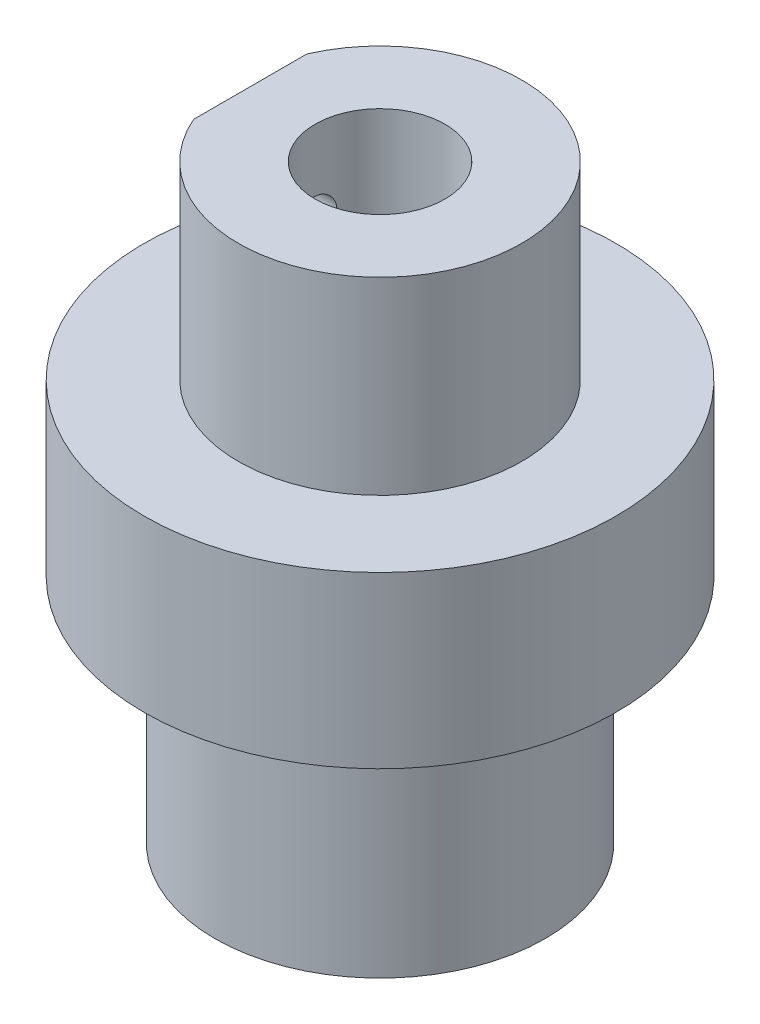
ISO-10303-21;
HEADER;
FILE_DESCRIPTION(('STEP AP214'),'2;1');
FILE_NAME('part.step','',(''),(''),'','','');
FILE_SCHEMA(('AUTOMOTIVE_DESIGN { 1 0 10303 214 1 1 1 1 }'));
ENDSEC;
DATA;
#1=APPLICATION_CONTEXT('core data for automotive mechanical design processes');
#2=APPLICATION_PROTOCOL_DEFINITION('international standard','automotive_design',2000,#1);
#3=PRODUCT_CONTEXT('',#1,'mechanical');
#4=PRODUCT('Part','Part','',(#3));
#5=PRODUCT_RELATED_PRODUCT_CATEGORY('part','',(#4));
#6=PRODUCT_DEFINITION_FORMATION('','',#4);
#7=PRODUCT_DEFINITION_CONTEXT('part definition',#1,'design');
#8=PRODUCT_DEFINITION('design','',#6,#7);
#9=PRODUCT_DEFINITION_SHAPE('','',#8);
#10=(LENGTH_UNIT() NAMED_UNIT(*) SI_UNIT(.MILLI.,.METRE.));
#11=(NAMED_UNIT(*) PLANE_ANGLE_UNIT() SI_UNIT($,.RADIAN.));
#12=(NAMED_UNIT(*) SI_UNIT($,.STERADIAN.) SOLID_ANGLE_UNIT());
#13=UNCERTAINTY_MEASURE_WITH_UNIT(LENGTH_MEASURE(1.E-05),#10,'distance_accuracy_value','');
#14=(GEOMETRIC_REPRESENTATION_CONTEXT(3) GLOBAL_UNCERTAINTY_ASSIGNED_CONTEXT((#13)) GLOBAL_UNIT_ASSIGNED_CONTEXT((#10,
#11,#12)) REPRESENTATION_CONTEXT('',''));
#15=CARTESIAN_POINT('',(0.,0.,0.));
#16=DIRECTION('',(0.,0.,1.));
#17=DIRECTION('',(1.,0.,0.));
#18=AXIS2_PLACEMENT_3D('',#15,#16,#17);
#19=CARTESIAN_POINT('',(0.,17.,0.));
#20=DIRECTION('',(0.,1.,0.));
#21=DIRECTION('',(0.,0.,1.));
#22=AXIS2_PLACEMENT_3D('',#19,#20,#21);
#23=PLANE('',#22);
#24=CARTESIAN_POINT('',(0.,17.,0.));
#25=DIRECTION('',(0.,1.,0.));
#26=DIRECTION('',(0.,0.,1.));
#27=AXIS2_PLACEMENT_3D('',#24,#25,#26);
#28=CIRCLE('',#27,10.);
#29=CARTESIAN_POINT('',(0.,17.,10.));
#30=VERTEX_POINT('',#29);
#31=EDGE_CURVE('E116',#30,#30,#28,.T.);
#32=ORIENTED_EDGE('',*,*,#31,.T.);
#33=EDGE_LOOP('',(#32));
#34=FACE_BOUND('',#33,.T.);
#35=DIRECTION('',(0.,0.,1.));
#36=VECTOR('',#35,1.);
#37=CARTESIAN_POINT('',(-5.5,17.,-2.39791576165636));
#38=LINE('',#37,#36);
#39=CARTESIAN_POINT('',(-5.5,17.,-2.39791576165636));
#40=VERTEX_POINT('',#39);
#41=CARTESIAN_POINT('',(-5.5,17.,2.39791576165636));
#42=VERTEX_POINT('',#41);
#43=EDGE_CURVE('E83',#40,#42,#38,.T.);
#44=ORIENTED_EDGE('',*,*,#43,.F.);
#45=CARTESIAN_POINT('',(0.,17.,0.));
#46=DIRECTION('',(0.,1.,0.));
#47=DIRECTION('',(0.,0.,1.));
#48=AXIS2_PLACEMENT_3D('',#45,#46,#47);
#49=CIRCLE('',#48,6.);
#50=EDGE_CURVE('E68',#42,#40,#49,.T.);
#51=ORIENTED_EDGE('',*,*,#50,.F.);
#52=EDGE_LOOP('',(#44,#51));
#53=FACE_BOUND('',#52,.T.);
#54=ADVANCED_FACE('F45',(#34,#53),#23,.T.);
#55=CARTESIAN_POINT('',(0.,9.8,0.));
#56=DIRECTION('',(0.,-1.,0.));
#57=DIRECTION('',(0.,0.,-1.));
#58=AXIS2_PLACEMENT_3D('',#55,#56,#57);
#59=CYLINDRICAL_SURFACE('',#58,7.);
#60=CARTESIAN_POINT('',(0.,9.8,0.));
#61=DIRECTION('',(0.,1.,0.));
#62=DIRECTION('',(0.,0.,1.));
#63=AXIS2_PLACEMENT_3D('',#60,#61,#62);
#64=CIRCLE('',#63,7.);
#65=CARTESIAN_POINT('',(0.,9.8,7.));
#66=VERTEX_POINT('',#65);
#67=EDGE_CURVE('E11',#66,#66,#64,.T.);
#68=ORIENTED_EDGE('',*,*,#67,.F.);
#69=EDGE_LOOP('',(#68));
#70=FACE_BOUND('',#69,.T.);
#71=CARTESIAN_POINT('',(0.,0.,0.));
#72=DIRECTION('',(0.,1.,0.));
#73=DIRECTION('',(0.,0.,1.));
#74=AXIS2_PLACEMENT_3D('',#71,#72,#73);
#75=CIRCLE('',#74,7.);
#76=CARTESIAN_POINT('',(0.,0.,7.));
#77=VERTEX_POINT('',#76);
#78=EDGE_CURVE('E60',#77,#77,#75,.T.);
#79=ORIENTED_EDGE('',*,*,#78,.T.);
#80=EDGE_LOOP('',(#79));
#81=FACE_BOUND('',#80,.T.);
#82=ADVANCED_FACE('F47',(#70,#81),#59,.T.);
#83=CARTESIAN_POINT('',(0.,0.,0.));
#84=DIRECTION('',(0.,1.,0.));
#85=DIRECTION('',(0.,0.,1.));
#86=AXIS2_PLACEMENT_3D('',#83,#84,#85);
#87=PLANE('',#86);
#88=CARTESIAN_POINT('',(0.,0.,0.));
#89=DIRECTION('',(0.,-1.,0.));
#90=DIRECTION('',(0.,0.,-1.));
#91=AXIS2_PLACEMENT_3D('',#88,#89,#90);
#92=CIRCLE('',#91,3.39999999999999);
#93=CARTESIAN_POINT('',(0.,0.,-3.39999999999999));
#94=VERTEX_POINT('',#93);
#95=EDGE_CURVE('E107',#94,#94,#92,.T.);
#96=ORIENTED_EDGE('',*,*,#95,.F.);
#97=EDGE_LOOP('',(#96));
#98=FACE_BOUND('',#97,.T.);
#99=ORIENTED_EDGE('',*,*,#78,.F.);
#100=EDGE_LOOP('',(#99));
#101=FACE_BOUND('',#100,.T.);
#102=ADVANCED_FACE('F127',(#98,#101),#87,.F.);
#103=CARTESIAN_POINT('',(0.,17.,0.));
#104=DIRECTION('',(0.,-1.,0.));
#105=DIRECTION('',(0.,0.,-1.));
#106=AXIS2_PLACEMENT_3D('',#103,#104,#105);
#107=CYLINDRICAL_SURFACE('',#106,10.);
#108=ORIENTED_EDGE('',*,*,#31,.F.);
#109=EDGE_LOOP('',(#108));
#110=FACE_BOUND('',#109,.T.);
#111=CARTESIAN_POINT('',(0.,9.8,0.));
#112=DIRECTION('',(0.,1.,0.));
#113=DIRECTION('',(0.,0.,1.));
#114=AXIS2_PLACEMENT_3D('',#111,#112,#113);
#115=CIRCLE('',#114,10.);
#116=CARTESIAN_POINT('',(0.,9.8,10.));
#117=VERTEX_POINT('',#116);
#118=EDGE_CURVE('E115',#117,#117,#115,.T.);
#119=ORIENTED_EDGE('',*,*,#118,.T.);
#120=EDGE_LOOP('',(#119));
#121=FACE_BOUND('',#120,.T.);
#122=ADVANCED_FACE('F129',(#110,#121),#107,.T.);
#123=CARTESIAN_POINT('',(0.,9.8,0.));
#124=DIRECTION('',(0.,1.,0.));
#125=DIRECTION('',(0.,0.,1.));
#126=AXIS2_PLACEMENT_3D('',#123,#124,#125);
#127=PLANE('',#126);
#128=ORIENTED_EDGE('',*,*,#67,.T.);
#129=EDGE_LOOP('',(#128));
#130=FACE_BOUND('',#129,.T.);
#131=ORIENTED_EDGE('',*,*,#118,.F.);
#132=EDGE_LOOP('',(#131));
#133=FACE_BOUND('',#132,.T.);
#134=ADVANCED_FACE('F135',(#130,#133),#127,.F.);
#135=CARTESIAN_POINT('',(0.,0.,0.));
#136=DIRECTION('',(0.,-1.,0.));
#137=DIRECTION('',(0.,0.,-1.));
#138=AXIS2_PLACEMENT_3D('',#135,#136,#137);
#139=CYLINDRICAL_SURFACE('',#138,3.39999999999999);
#140=CARTESIAN_POINT('',(0.,17.,0.));
#141=DIRECTION('',(0.,-1.,0.));
#142=DIRECTION('',(0.,0.,-1.));
#143=AXIS2_PLACEMENT_3D('',#140,#141,#142);
#144=CIRCLE('',#143,3.39999999999999);
#145=CARTESIAN_POINT('',(0.,17.,-3.39999999999999));
#146=VERTEX_POINT('',#145);
#147=EDGE_CURVE('E111',#146,#146,#144,.T.);
#148=ORIENTED_EDGE('',*,*,#147,.F.);
#149=EDGE_LOOP('',(#148));
#150=FACE_BOUND('',#149,.T.);
#151=ORIENTED_EDGE('',*,*,#95,.T.);
#152=EDGE_LOOP('',(#151));
#153=FACE_BOUND('',#152,.T.);
#154=ADVANCED_FACE('F147',(#150,#153),#139,.F.);
#155=CARTESIAN_POINT('',(0.,17.,0.));
#156=DIRECTION('',(0.,1.,0.));
#157=DIRECTION('',(0.,0.,1.));
#158=AXIS2_PLACEMENT_3D('',#155,#156,#157);
#159=PLANE('',#158);
#160=CARTESIAN_POINT('',(0.,17.,0.));
#161=DIRECTION('',(0.,1.,0.));
#162=DIRECTION('',(0.,0.,1.));
#163=AXIS2_PLACEMENT_3D('',#160,#161,#162);
#164=CIRCLE('',#163,2.75);
#165=CARTESIAN_POINT('',(0.,17.,2.75));
#166=VERTEX_POINT('',#165);
#167=EDGE_CURVE('E96',#166,#166,#164,.T.);
#168=ORIENTED_EDGE('',*,*,#167,.T.);
#169=EDGE_LOOP('',(#168));
#170=FACE_BOUND('',#169,.T.);
#171=ORIENTED_EDGE('',*,*,#147,.T.);
#172=EDGE_LOOP('',(#171));
#173=FACE_BOUND('',#172,.T.);
#174=ADVANCED_FACE('F154',(#170,#173),#159,.F.);
#175=CARTESIAN_POINT('',(0.,25.,0.));
#176=DIRECTION('',(0.,-1.,0.));
#177=DIRECTION('',(0.,0.,-1.));
#178=AXIS2_PLACEMENT_3D('',#175,#176,#177);
#179=CYLINDRICAL_SURFACE('',#178,6.);
#180=ORIENTED_EDGE('',*,*,#50,.T.);
#181=DIRECTION('',(0.,-1.,0.));
#182=VECTOR('',#181,1.);
#183=CARTESIAN_POINT('',(-5.5,25.,-2.39791576165636));
#184=LINE('',#183,#182);
#185=CARTESIAN_POINT('',(-5.5,25.,-2.39791576165636));
#186=VERTEX_POINT('',#185);
#187=EDGE_CURVE('E87',#186,#40,#184,.T.);
#188=ORIENTED_EDGE('',*,*,#187,.F.);
#189=CARTESIAN_POINT('',(0.,25.,0.));
#190=DIRECTION('',(0.,1.,0.));
#191=DIRECTION('',(0.,0.,1.));
#192=AXIS2_PLACEMENT_3D('',#189,#190,#191);
#193=CIRCLE('',#192,6.);
#194=CARTESIAN_POINT('',(-5.5,25.,2.39791576165636));
#195=VERTEX_POINT('',#194);
#196=EDGE_CURVE('E90',#195,#186,#193,.T.);
#197=ORIENTED_EDGE('',*,*,#196,.F.);
#198=DIRECTION('',(0.,-1.,0.));
#199=VECTOR('',#198,1.);
#200=CARTESIAN_POINT('',(-5.5,25.,2.39791576165636));
#201=LINE('',#200,#199);
#202=EDGE_CURVE('E85',#195,#42,#201,.T.);
#203=ORIENTED_EDGE('',*,*,#202,.T.);
#204=EDGE_LOOP('',(#180,#188,#197,#203));
#205=FACE_BOUND('',#204,.T.);
#206=ADVANCED_FACE('F92',(#205),#179,.T.);
#207=CARTESIAN_POINT('',(-5.5,25.,-2.39791576165636));
#208=DIRECTION('',(1.,0.,0.));
#209=DIRECTION('',(0.,0.,-1.));
#210=AXIS2_PLACEMENT_3D('',#207,#208,#209);
#211=PLANE('',#210);
#212=CARTESIAN_POINT('',(-5.5,21.5521341556968,0.));
#213=DIRECTION('',(-1.,0.,0.));
#214=DIRECTION('',(0.,0.,1.));
#215=AXIS2_PLACEMENT_3D('',#212,#213,#214);
#216=CIRCLE('',#215,0.799999999999999);
#217=CARTESIAN_POINT('',(-5.5,21.5521341556968,0.799999999999999));
#218=VERTEX_POINT('',#217);
#219=EDGE_CURVE('E183',#218,#218,#216,.T.);
#220=ORIENTED_EDGE('',*,*,#219,.F.);
#221=EDGE_LOOP('',(#220));
#222=FACE_BOUND('',#221,.T.);
#223=ORIENTED_EDGE('',*,*,#43,.T.);
#224=ORIENTED_EDGE('',*,*,#202,.F.);
#225=DIRECTION('',(0.,0.,1.));
#226=VECTOR('',#225,1.);
#227=CARTESIAN_POINT('',(-5.5,25.,-2.39791576165636));
#228=LINE('',#227,#226);
#229=EDGE_CURVE('E76',#186,#195,#228,.T.);
#230=ORIENTED_EDGE('',*,*,#229,.F.);
#231=ORIENTED_EDGE('',*,*,#187,.T.);
#232=EDGE_LOOP('',(#223,#224,#230,#231));
#233=FACE_BOUND('',#232,.T.);
#234=ADVANCED_FACE('F84',(#222,#233),#211,.F.);
#235=CARTESIAN_POINT('',(0.,25.,0.));
#236=DIRECTION('',(0.,1.,0.));
#237=DIRECTION('',(0.,0.,1.));
#238=AXIS2_PLACEMENT_3D('',#235,#236,#237);
#239=PLANE('',#238);
#240=CARTESIAN_POINT('',(0.,25.,0.));
#241=DIRECTION('',(0.,1.,0.));
#242=DIRECTION('',(0.,0.,1.));
#243=AXIS2_PLACEMENT_3D('',#240,#241,#242);
#244=CIRCLE('',#243,2.75);
#245=CARTESIAN_POINT('',(0.,25.,2.75));
#246=VERTEX_POINT('',#245);
#247=EDGE_CURVE('E100',#246,#246,#244,.T.);
#248=ORIENTED_EDGE('',*,*,#247,.F.);
#249=EDGE_LOOP('',(#248));
#250=FACE_BOUND('',#249,.T.);
#251=ORIENTED_EDGE('',*,*,#196,.T.);
#252=ORIENTED_EDGE('',*,*,#229,.T.);
#253=EDGE_LOOP('',(#251,#252));
#254=FACE_BOUND('',#253,.T.);
#255=ADVANCED_FACE('F173',(#250,#254),#239,.T.);
#256=CARTESIAN_POINT('',(0.,16.,0.));
#257=DIRECTION('',(0.,1.,0.));
#258=DIRECTION('',(0.,0.,1.));
#259=AXIS2_PLACEMENT_3D('',#256,#257,#258);
#260=CYLINDRICAL_SURFACE('',#259,2.75);
#261=CARTESIAN_POINT('',(-2.63106442338457,21.5521341556968,0.799999999999999));
#262=CARTESIAN_POINT('',(-2.63106498532825,21.5960377445542,0.799999293005007));
#263=CARTESIAN_POINT('',(-2.63217535203564,21.6399484074499,0.796373589951704));
#264=CARTESIAN_POINT('',(-2.63648039461676,21.7264903877582,0.782001092598375));
#265=CARTESIAN_POINT('',(-2.63967586343063,21.7691212120091,0.771251589175429));
#266=CARTESIAN_POINT('',(-2.64775924196828,21.8518384881091,0.743023819210025));
#267=CARTESIAN_POINT('',(-2.65264446051054,21.8919288665889,0.725556247284365));
#268=CARTESIAN_POINT('',(-2.66355331651517,21.9686190259245,0.684422899872756));
#269=CARTESIAN_POINT('',(-2.66957710193598,22.0052183521818,0.660756318662069));
#270=CARTESIAN_POINT('',(-2.68228535560897,22.0749765388996,0.607142995267404));
#271=CARTESIAN_POINT('',(-2.68898325094155,22.1080161486735,0.577044239967328));
#272=CARTESIAN_POINT('',(-2.70217001122196,22.1686571680148,0.511747064017308));
#273=CARTESIAN_POINT('',(-2.708658850774,22.1962579189463,0.476548026627076));
#274=CARTESIAN_POINT('',(-2.72084814485847,22.2457497125047,0.401207194335078));
#275=CARTESIAN_POINT('',(-2.72653092791886,22.2675200249535,0.360982982365372));
#276=CARTESIAN_POINT('',(-2.73631236546955,22.3039418138624,0.277251420927643));
#277=CARTESIAN_POINT('',(-2.74041134020196,22.3185947295967,0.233744737295945));
#278=CARTESIAN_POINT('',(-2.74646833178993,22.3399736130488,0.145930049433169));
#279=CARTESIAN_POINT('',(-2.74848116955105,22.3469029382659,0.101675402475544));
#280=CARTESIAN_POINT('',(-2.75033176147379,22.3532800482013,0.0125889848936128));
#281=CARTESIAN_POINT('',(-2.75016994611695,22.352729313628,-0.0322426697542662));
#282=CARTESIAN_POINT('',(-2.74772861834208,22.344300344072,-0.119787040217146));
#283=CARTESIAN_POINT('',(-2.74551270934088,22.3366421767467,-0.162522995281589));
#284=CARTESIAN_POINT('',(-2.73928883323124,22.3145740850036,-0.246074653931755));
#285=CARTESIAN_POINT('',(-2.73528075539619,22.3001637434097,-0.286890238697879));
#286=CARTESIAN_POINT('',(-2.72583315739304,22.2648458793482,-0.365976564556493));
#287=CARTESIAN_POINT('',(-2.72037811139596,22.2438674124339,-0.404213692650055));
#288=CARTESIAN_POINT('',(-2.70861783769554,22.1960644099259,-0.476696623948599));
#289=CARTESIAN_POINT('',(-2.70231241819658,22.1692385546523,-0.510941523477196));
#290=CARTESIAN_POINT('',(-2.6892582537993,22.1093530840887,-0.575781614552019));
#291=CARTESIAN_POINT('',(-2.68250172529671,22.0761023797289,-0.606198980219794));
#292=CARTESIAN_POINT('',(-2.66950898167509,22.0049046925227,-0.661074231466078));
#293=CARTESIAN_POINT('',(-2.66327281208477,21.9669572994602,-0.685531595934116));
#294=CARTESIAN_POINT('',(-2.65199123975198,21.8869989494769,-0.727963409978493));
#295=CARTESIAN_POINT('',(-2.64695646379906,21.8449560498428,-0.745880696710052));
#296=CARTESIAN_POINT('',(-2.63877516258316,21.7582699966755,-0.774330202948874));
#297=CARTESIAN_POINT('',(-2.63562806431447,21.7136276367288,-0.78486466368108));
#298=CARTESIAN_POINT('',(-2.63170318529082,21.6246941545249,-0.797924501943338));
#299=CARTESIAN_POINT('',(-2.63084589668781,21.5804459917973,-0.800718771123356));
#300=CARTESIAN_POINT('',(-2.63137849148964,21.4921127187158,-0.798966979687972));
#301=CARTESIAN_POINT('',(-2.63276808248428,21.4480275878931,-0.794421874223058));
#302=CARTESIAN_POINT('',(-2.63756016997692,21.3623685948923,-0.778359180262025));
#303=CARTESIAN_POINT('',(-2.64091358774499,21.3207598612803,-0.767011440744925));
#304=CARTESIAN_POINT('',(-2.64920545134255,21.2400386293938,-0.737860830970601));
#305=CARTESIAN_POINT('',(-2.65414413172626,21.2009265015425,-0.720057005425354));
#306=CARTESIAN_POINT('',(-2.66520677006814,21.125206214126,-0.677979543745894));
#307=CARTESIAN_POINT('',(-2.67135774482399,21.0886873557478,-0.653552482949148));
#308=CARTESIAN_POINT('',(-2.68409235832412,21.0201685747022,-0.599106366149659));
#309=CARTESIAN_POINT('',(-2.69067609414062,20.988169671005,-0.569086052740384));
#310=CARTESIAN_POINT('',(-2.7038147638806,20.9284401281565,-0.503047140334094));
#311=CARTESIAN_POINT('',(-2.71036053492561,20.9008992677583,-0.466854664839583));
#312=CARTESIAN_POINT('',(-2.72245124125083,20.8522791891525,-0.39020787965237));
#313=CARTESIAN_POINT('',(-2.72799622809324,20.8311996380074,-0.349753789695879));
#314=CARTESIAN_POINT('',(-2.73742571510339,20.7963029455776,-0.266008434889276));
#315=CARTESIAN_POINT('',(-2.74132271018015,20.7824309664988,-0.22274149815064));
#316=CARTESIAN_POINT('',(-2.74707232737135,20.7621963326214,-0.134357806676721));
#317=CARTESIAN_POINT('',(-2.74892549640084,20.7558316688804,-0.0892415501610387));
#318=CARTESIAN_POINT('',(-2.75034745854921,20.7509376338872,-0.000198878417870527));
#319=CARTESIAN_POINT('',(-2.7499967369729,20.7521322132125,0.0437112745768936));
#320=CARTESIAN_POINT('',(-2.74723784736569,20.7616682188418,0.130678876551641));
#321=CARTESIAN_POINT('',(-2.74482978423152,20.7700092807713,0.173736368891325));
#322=CARTESIAN_POINT('',(-2.73824784740996,20.7934344626341,0.257378246369065));
#323=CARTESIAN_POINT('',(-2.73409108809799,20.8084533065355,0.297982351199971));
#324=CARTESIAN_POINT('',(-2.72444267748879,20.8447495792459,0.376116403318522));
#325=CARTESIAN_POINT('',(-2.71895081472936,20.8660279995989,0.41364586236395));
#326=CARTESIAN_POINT('',(-2.70700332752446,20.9149947600146,0.485811159695983));
#327=CARTESIAN_POINT('',(-2.70052337605274,20.9428591426309,0.520323491623148));
#328=CARTESIAN_POINT('',(-2.68741332578494,21.0038851292179,0.584275122464167));
#329=CARTESIAN_POINT('',(-2.68078318533446,21.0370482185942,0.613712994011445));
#330=CARTESIAN_POINT('',(-2.66790988456133,21.1088264566276,0.667490776391365));
#331=CARTESIAN_POINT('',(-2.6616823958989,21.1475665329042,0.691668090953955));
#332=CARTESIAN_POINT('',(-2.65056124885496,21.2287371227446,0.733136268334313));
#333=CARTESIAN_POINT('',(-2.64566688160147,21.2711656591164,0.750430793261208));
#334=CARTESIAN_POINT('',(-2.63830679204149,21.3530959767766,0.775880227557745));
#335=CARTESIAN_POINT('',(-2.63561547712475,21.3923101879857,0.784901316689631));
#336=CARTESIAN_POINT('',(-2.63199418716525,21.4717257878558,0.79696101143949));
#337=CARTESIAN_POINT('',(-2.63106390875344,21.511927005279,0.800000647469937));
#338=CARTESIAN_POINT('',(-2.63106442338457,21.5521341556968,0.799999999999999));
#339=B_SPLINE_CURVE_WITH_KNOTS('',3,(#261,#262,#263,#264,#265,#266,#267,#268,#269,#270,#271,
#272,#273,#274,#275,#276,#277,#278,#279,#280,#281,#282,#283,#284,#285,#286,#287,#288,#289,#290,
#291,#292,#293,#294,#295,#296,#297,#298,#299,#300,#301,#302,#303,#304,#305,#306,#307,#308,#309,
#310,#311,#312,#313,#314,#315,#316,#317,#318,#319,#320,#321,#322,#323,#324,#325,#326,#327,#328,
#329,#330,#331,#332,#333,#334,#335,#336,#337,#338),.UNSPECIFIED.,.T.,.F.,(4,2,2,2,2,2,2,2,2,2,2,
2,2,2,2,2,2,2,2,2,2,2,2,2,2,2,2,2,2,2,2,2,2,2,2,2,2,2,4),(0.,0.131562586861102,
0.263175234628892,0.394579227267369,0.526000307802643,0.66096192273264,0.795939871236973,
0.933527909995664,1.07108811421781,1.20493396393638,1.33875331870804,1.46856269284115,
1.59838008817151,1.7296510946585,1.86095175804352,1.99702328491527,2.13310670488467,
2.27035257379145,2.40755676052105,2.53993089658846,2.6722878067971,2.80147015005798,
2.93067161585436,3.06316821685721,3.19569464014159,3.33288371551472,3.47006572064093,
3.60618812108394,3.74227408718034,3.87341985661712,4.00455893978321,4.13444338191192,
4.26434840938596,4.39822403657967,4.53213725966839,4.66973588642737,4.80726120322542,
4.9277677118996,5.04825345935047),.UNSPECIFIED.);
#340=CARTESIAN_POINT('',(-2.63106442338457,21.5521341556968,0.799999999999999));
#341=VERTEX_POINT('',#340);
#342=EDGE_CURVE('E49',#341,#341,#339,.T.);
#343=ORIENTED_EDGE('',*,*,#342,.T.);
#344=EDGE_LOOP('',(#343));
#345=FACE_BOUND('',#344,.T.);
#346=ORIENTED_EDGE('',*,*,#247,.T.);
#347=EDGE_LOOP('',(#346));
#348=FACE_BOUND('',#347,.T.);
#349=ORIENTED_EDGE('',*,*,#167,.F.);
#350=EDGE_LOOP('',(#349));
#351=FACE_BOUND('',#350,.T.);
#352=ADVANCED_FACE('F179',(#345,#348,#351),#260,.F.);
#353=CARTESIAN_POINT('',(-5.5,21.5521341556968,0.));
#354=DIRECTION('',(-1.,0.,0.));
#355=DIRECTION('',(0.,0.,1.));
#356=AXIS2_PLACEMENT_3D('',#353,#354,#355);
#357=CYLINDRICAL_SURFACE('',#356,0.799999999999999);
#358=ORIENTED_EDGE('',*,*,#219,.T.);
#359=EDGE_LOOP('',(#358));
#360=FACE_BOUND('',#359,.T.);
#361=ORIENTED_EDGE('',*,*,#342,.F.);
#362=EDGE_LOOP('',(#361));
#363=FACE_BOUND('',#362,.T.);
#364=ADVANCED_FACE('F198',(#360,#363),#357,.F.);
#365=CLOSED_SHELL('',(#54,#82,#102,#122,#134,#154,#174,#206,#234,#255,#352,#364));
#366=MANIFOLD_SOLID_BREP('B2',#365);
#367=ADVANCED_BREP_SHAPE_REPRESENTATION('',(#18,#366),#14);
#368=SHAPE_DEFINITION_REPRESENTATION(#9,#367);
ENDSEC;
END-ISO-10303-21;
